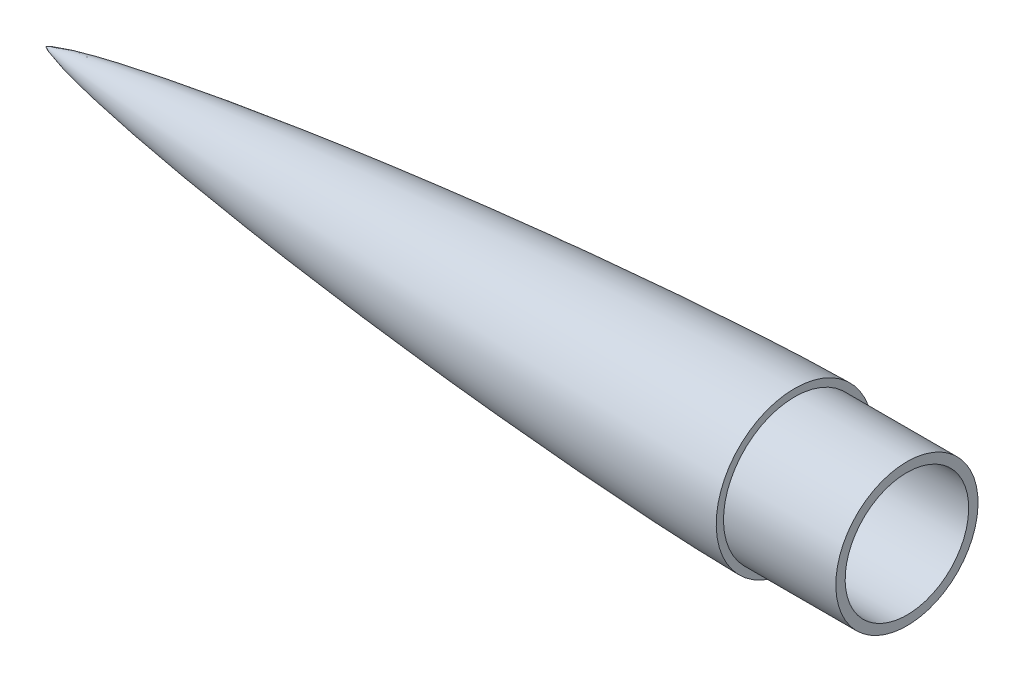
ISO-10303-21;
HEADER;
FILE_DESCRIPTION(('STEP AP214'),'2;1');
FILE_NAME('part.step','',(''),(''),'','','');
FILE_SCHEMA(('AUTOMOTIVE_DESIGN { 1 0 10303 214 1 1 1 1 }'));
ENDSEC;
DATA;
#1=APPLICATION_CONTEXT('core data for automotive mechanical design processes');
#2=APPLICATION_PROTOCOL_DEFINITION('international standard','automotive_design',2000,#1);
#3=PRODUCT_CONTEXT('',#1,'mechanical');
#4=PRODUCT('Part','Part','',(#3));
#5=PRODUCT_RELATED_PRODUCT_CATEGORY('part','',(#4));
#6=PRODUCT_DEFINITION_FORMATION('','',#4);
#7=PRODUCT_DEFINITION_CONTEXT('part definition',#1,'design');
#8=PRODUCT_DEFINITION('design','',#6,#7);
#9=PRODUCT_DEFINITION_SHAPE('','',#8);
#10=(LENGTH_UNIT() NAMED_UNIT(*) SI_UNIT(.MILLI.,.METRE.));
#11=(NAMED_UNIT(*) PLANE_ANGLE_UNIT() SI_UNIT($,.RADIAN.));
#12=(NAMED_UNIT(*) SI_UNIT($,.STERADIAN.) SOLID_ANGLE_UNIT());
#13=UNCERTAINTY_MEASURE_WITH_UNIT(LENGTH_MEASURE(1.E-05),#10,'distance_accuracy_value','');
#14=(GEOMETRIC_REPRESENTATION_CONTEXT(3) GLOBAL_UNCERTAINTY_ASSIGNED_CONTEXT((#13)) GLOBAL_UNIT_ASSIGNED_CONTEXT((#10,
#11,#12)) REPRESENTATION_CONTEXT('',''));
#15=CARTESIAN_POINT('',(0.,0.,0.));
#16=DIRECTION('',(0.,0.,1.));
#17=DIRECTION('',(1.,0.,0.));
#18=AXIS2_PLACEMENT_3D('',#15,#16,#17);
#19=CARTESIAN_POINT('',(-460.,0.,0.));
#20=CARTESIAN_POINT('',(-459.996067969247,0.00972601785860918,0.));
#21=CARTESIAN_POINT('',(-459.985785216802,0.0278042399842785,0.));
#22=CARTESIAN_POINT('',(-459.957005025185,0.0589024256451873,0.));
#23=CARTESIAN_POINT('',(-459.912050009554,0.100212526419041,0.));
#24=CARTESIAN_POINT('',(-459.856244624076,0.143432876094983,0.));
#25=CARTESIAN_POINT('',(-459.775484012374,0.200311334666108,0.));
#26=CARTESIAN_POINT('',(-459.68346872574,0.25861177941545,0.));
#27=CARTESIAN_POINT('',(-459.579785861584,0.319460143878657,0.));
#28=CARTESIAN_POINT('',(-459.418939028363,0.407565244063022,0.));
#29=CARTESIAN_POINT('',(-459.180873374265,0.528192027764997,0.));
#30=CARTESIAN_POINT('',(-458.777616559426,0.714285403089724,0.));
#31=CARTESIAN_POINT('',(-458.057255832982,1.0123177997448,0.));
#32=CARTESIAN_POINT('',(-456.771507758202,1.48347478448861,0.));
#33=CARTESIAN_POINT('',(-454.407221910136,2.24184472915873,0.));
#34=CARTESIAN_POINT('',(-449.963807437131,3.4745432886412,0.));
#35=CARTESIAN_POINT('',(-442.199798746274,5.32116234592988,0.));
#36=CARTESIAN_POINT('',(-428.971010790382,8.02666514738443,0.));
#37=CARTESIAN_POINT('',(-410.788345473747,11.2204245689005,0.));
#38=CARTESIAN_POINT('',(-388.732813480205,14.6344279108419,0.));
#39=CARTESIAN_POINT('',(-364.190784602938,18.0369182632636,0.));
#40=CARTESIAN_POINT('',(-339.610222302371,21.1458555804465,0.));
#41=CARTESIAN_POINT('',(-315.00008173978,24.0107824227259,0.));
#42=CARTESIAN_POINT('',(-290.366278157824,26.6634297507846,0.));
#43=CARTESIAN_POINT('',(-265.712399696512,29.1224072592765,0.));
#44=CARTESIAN_POINT('',(-241.041086642794,31.3994061599892,0.));
#45=CARTESIAN_POINT('',(-216.354099064126,33.4997581908471,0.));
#46=CARTESIAN_POINT('',(-191.652773648049,35.4240464742027,0.));
#47=CARTESIAN_POINT('',(-170.027352252732,36.9495078546721,0.));
#48=CARTESIAN_POINT('',(-151.483266154204,38.1371097344127,0.));
#49=CARTESIAN_POINT('',(-136.024634605966,39.0404364458488,0.));
#50=CARTESIAN_POINT('',(-123.65461922366,39.7077773358385,0.));
#51=CARTESIAN_POINT('',(-111.28149382399,40.3151254826194,0.));
#52=CARTESIAN_POINT('',(-100.452283742773,40.7881803504322,0.));
#53=CARTESIAN_POINT('',(-91.1681429847647,41.1459092210958,0.));
#54=CARTESIAN_POINT('',(-83.7072004518095,41.3976359339785,0.));
#55=CARTESIAN_POINT('',(-78.0703615795339,41.5664952598044,0.));
#56=CARTESIAN_POINT('',(-73.3454843724536,41.6882842909737,0.));
#57=CARTESIAN_POINT('',(-69.5328722986243,41.7726603001715,0.));
#58=CARTESIAN_POINT('',(-66.3554636713874,41.8303616185867,0.));
#59=CARTESIAN_POINT('',(-63.8133963766368,41.8701394323888,0.));
#60=CARTESIAN_POINT('',(-61.9067400464002,41.8887455615189,0.));
#61=CARTESIAN_POINT('',(-60.635587942199,41.9,0.));
#62=CARTESIAN_POINT('',(-60.,41.9,0.));
#63=B_SPLINE_CURVE_WITH_KNOTS('',4,(#19,#20,#21,#22,#23,#24,#25,#26,#27,#28,#29,#30,#31,#32,#33,
#34,#35,#36,#37,#38,#39,#40,#41,#42,#43,#44,#45,#46,#47,#48,#49,#50,#51,#52,#53,#54,#55,#56,#57,
#58,#59,#60,#61,#62),.UNSPECIFIED.,.F.,.F.,(5,1,1,1,1,1,1,1,1,1,1,1,1,1,1,1,1,1,1,1,1,1,1,1,1,1,
1,1,1,1,1,1,1,1,1,1,1,1,1,1,5),(0.,0.000103786164817077,0.000207572329634154,
0.000415144659268307,0.000608586606980789,0.000802028554693271,0.00118891245011823,
0.00149546016764879,0.00180200788517934,0.00262222852812061,0.00383759947407243,
0.00590299198548673,0.00953844094172427,0.0162116191413148,0.0284780596780815,
0.0516658112321629,0.0887423509322897,0.150226850844329,0.211711468109695,0.27319613199436,
0.334680785513107,0.396165341362797,0.457649955675801,0.519134578627764,0.580619210969018,
0.642103792696171,0.703588429200724,0.765073012567357,0.795815252477465,0.826557492387574,
0.857299765316496,0.888042038245417,0.918784374476109,0.934155542591455,0.949526710706801,
0.962145033030101,0.974763355353401,0.98107251651505,0.9873816776767,0.99369083883835,1.),.UNSPECIFIED.);
#64=CARTESIAN_POINT('',(-442.793127384424,0.,0.));
#65=DIRECTION('',(1.,0.,0.));
#66=AXIS1_PLACEMENT('',#64,#65);
#67=SURFACE_OF_REVOLUTION('',#63,#66);
#68=CARTESIAN_POINT('',(-60.,0.,0.));
#69=DIRECTION('',(1.,0.,0.));
#70=DIRECTION('',(0.,1.,0.));
#71=AXIS2_PLACEMENT_3D('',#68,#69,#70);
#72=CIRCLE('',#71,41.9);
#73=CARTESIAN_POINT('',(-60.,41.9,0.));
#74=VERTEX_POINT('',#73);
#75=EDGE_CURVE('E62',#74,#74,#72,.T.);
#76=ORIENTED_EDGE('',*,*,#75,.F.);
#77=EDGE_LOOP('',(#76));
#78=FACE_BOUND('',#77,.T.);
#79=CARTESIAN_POINT('',(-460.,0.,0.));
#80=VERTEX_POINT('',#79);
#81=VERTEX_LOOP('',#80);
#82=FACE_BOUND('',#81,.T.);
#83=ADVANCED_FACE('F38',(#78,#82),#67,.T.);
#84=CARTESIAN_POINT('',(-60.,-2071.94520391153,0.));
#85=DIRECTION('',(0.,0.,-1.));
#86=DIRECTION('',(0.,1.,0.));
#87=AXIS2_PLACEMENT_3D('',#84,#85,#86);
#88=CIRCLE('',#87,2107.00913770793);
#89=TRIMMED_CURVE('',#88,(PARAMETER_VALUE(-0.182690612366401)),
(PARAMETER_VALUE(0.182690612366401)),.T.,.PARAMETER.);
#90=CARTESIAN_POINT('',(-60.0000000000001,0.,0.));
#91=DIRECTION('',(1.,0.,0.));
#92=AXIS1_PLACEMENT('',#90,#91);
#93=SURFACE_OF_REVOLUTION('',#89,#92);
#94=CARTESIAN_POINT('',(-153.237304307811,0.,0.));
#95=DIRECTION('',(1.,0.,0.));
#96=DIRECTION('',(0.,1.,0.));
#97=AXIS2_PLACEMENT_3D('',#94,#95,#96);
#98=CIRCLE('',#97,33.);
#99=CARTESIAN_POINT('',(-153.237304307811,33.,0.));
#100=VERTEX_POINT('',#99);
#101=EDGE_CURVE('E11',#100,#100,#98,.T.);
#102=ORIENTED_EDGE('',*,*,#101,.T.);
#103=EDGE_LOOP('',(#102));
#104=FACE_BOUND('',#103,.T.);
#105=CARTESIAN_POINT('',(-442.793127384424,0.,0.));
#106=VERTEX_POINT('',#105);
#107=VERTEX_LOOP('',#106);
#108=FACE_BOUND('',#107,.T.);
#109=ADVANCED_FACE('F53',(#104,#108),#93,.F.);
#110=CARTESIAN_POINT('',(-442.793127384424,0.,0.));
#111=DIRECTION('',(1.,0.,0.));
#112=DIRECTION('',(0.,1.,0.));
#113=AXIS2_PLACEMENT_3D('',#110,#111,#112);
#114=CYLINDRICAL_SURFACE('',#113,33.);
#115=ORIENTED_EDGE('',*,*,#101,.F.);
#116=EDGE_LOOP('',(#115));
#117=FACE_BOUND('',#116,.T.);
#118=CARTESIAN_POINT('',(0.,0.,0.));
#119=DIRECTION('',(1.,0.,0.));
#120=DIRECTION('',(0.,1.,0.));
#121=AXIS2_PLACEMENT_3D('',#118,#119,#120);
#122=CIRCLE('',#121,33.);
#123=CARTESIAN_POINT('',(0.,33.,0.));
#124=VERTEX_POINT('',#123);
#125=EDGE_CURVE('E46',#124,#124,#122,.T.);
#126=ORIENTED_EDGE('',*,*,#125,.T.);
#127=EDGE_LOOP('',(#126));
#128=FACE_BOUND('',#127,.T.);
#129=ADVANCED_FACE('F58',(#117,#128),#114,.F.);
#130=CARTESIAN_POINT('',(0.,0.,0.));
#131=DIRECTION('',(1.,0.,0.));
#132=DIRECTION('',(0.,1.,0.));
#133=AXIS2_PLACEMENT_3D('',#130,#131,#132);
#134=PLANE('',#133);
#135=CARTESIAN_POINT('',(0.,0.,0.));
#136=DIRECTION('',(1.,0.,0.));
#137=DIRECTION('',(0.,1.,0.));
#138=AXIS2_PLACEMENT_3D('',#135,#136,#137);
#139=CIRCLE('',#138,38.);
#140=CARTESIAN_POINT('',(0.,38.,0.));
#141=VERTEX_POINT('',#140);
#142=EDGE_CURVE('E67',#141,#141,#139,.T.);
#143=ORIENTED_EDGE('',*,*,#142,.T.);
#144=EDGE_LOOP('',(#143));
#145=FACE_BOUND('',#144,.T.);
#146=ORIENTED_EDGE('',*,*,#125,.F.);
#147=EDGE_LOOP('',(#146));
#148=FACE_BOUND('',#147,.T.);
#149=ADVANCED_FACE('F78',(#145,#148),#134,.T.);
#150=CARTESIAN_POINT('',(-442.793127384424,0.,0.));
#151=DIRECTION('',(1.,0.,0.));
#152=DIRECTION('',(0.,1.,0.));
#153=AXIS2_PLACEMENT_3D('',#150,#151,#152);
#154=CYLINDRICAL_SURFACE('',#153,38.);
#155=CARTESIAN_POINT('',(-60.,0.,0.));
#156=DIRECTION('',(1.,0.,0.));
#157=DIRECTION('',(0.,1.,0.));
#158=AXIS2_PLACEMENT_3D('',#155,#156,#157);
#159=CIRCLE('',#158,38.);
#160=CARTESIAN_POINT('',(-60.,38.,0.));
#161=VERTEX_POINT('',#160);
#162=EDGE_CURVE('E64',#161,#161,#159,.T.);
#163=ORIENTED_EDGE('',*,*,#162,.T.);
#164=EDGE_LOOP('',(#163));
#165=FACE_BOUND('',#164,.T.);
#166=ORIENTED_EDGE('',*,*,#142,.F.);
#167=EDGE_LOOP('',(#166));
#168=FACE_BOUND('',#167,.T.);
#169=ADVANCED_FACE('F80',(#165,#168),#154,.T.);
#170=CARTESIAN_POINT('',(-60.,0.,0.));
#171=DIRECTION('',(1.,0.,0.));
#172=DIRECTION('',(0.,1.,0.));
#173=AXIS2_PLACEMENT_3D('',#170,#171,#172);
#174=PLANE('',#173);
#175=ORIENTED_EDGE('',*,*,#75,.T.);
#176=EDGE_LOOP('',(#175));
#177=FACE_BOUND('',#176,.T.);
#178=ORIENTED_EDGE('',*,*,#162,.F.);
#179=EDGE_LOOP('',(#178));
#180=FACE_BOUND('',#179,.T.);
#181=ADVANCED_FACE('F87',(#177,#180),#174,.T.);
#182=CLOSED_SHELL('',(#83,#109,#129,#149,#169,#181));
#183=MANIFOLD_SOLID_BREP('B2',#182);
#184=ADVANCED_BREP_SHAPE_REPRESENTATION('',(#18,#183),#14);
#185=SHAPE_DEFINITION_REPRESENTATION(#9,#184);
ENDSEC;
END-ISO-10303-21;
